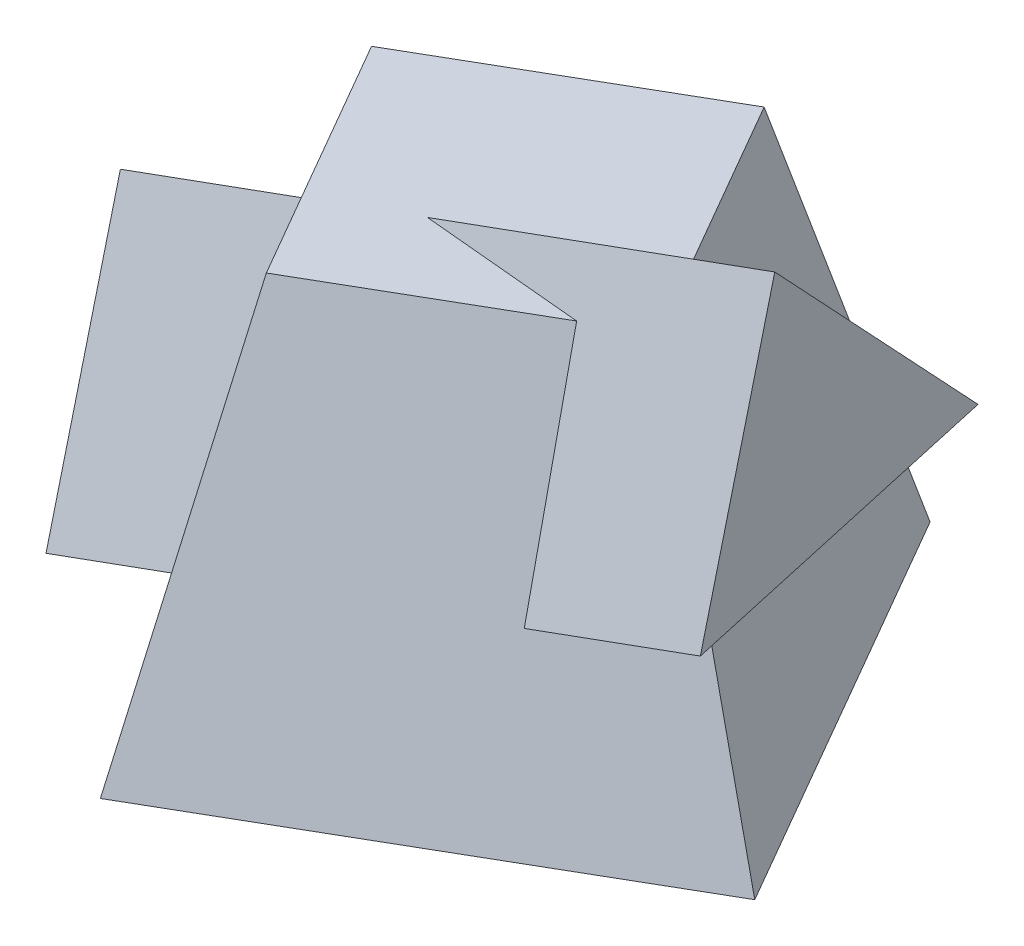
ISO-10303-21;
HEADER;
FILE_DESCRIPTION(('STEP AP214'),'2;1');
FILE_NAME('part.step','',(''),(''),'','','');
FILE_SCHEMA(('AUTOMOTIVE_DESIGN { 1 0 10303 214 1 1 1 1 }'));
ENDSEC;
DATA;
#1=APPLICATION_CONTEXT('core data for automotive mechanical design processes');
#2=APPLICATION_PROTOCOL_DEFINITION('international standard','automotive_design',2000,#1);
#3=PRODUCT_CONTEXT('',#1,'mechanical');
#4=PRODUCT('Part','Part','',(#3));
#5=PRODUCT_RELATED_PRODUCT_CATEGORY('part','',(#4));
#6=PRODUCT_DEFINITION_FORMATION('','',#4);
#7=PRODUCT_DEFINITION_CONTEXT('part definition',#1,'design');
#8=PRODUCT_DEFINITION('design','',#6,#7);
#9=PRODUCT_DEFINITION_SHAPE('','',#8);
#10=(LENGTH_UNIT() NAMED_UNIT(*) SI_UNIT(.MILLI.,.METRE.));
#11=(NAMED_UNIT(*) PLANE_ANGLE_UNIT() SI_UNIT($,.RADIAN.));
#12=(NAMED_UNIT(*) SI_UNIT($,.STERADIAN.) SOLID_ANGLE_UNIT());
#13=UNCERTAINTY_MEASURE_WITH_UNIT(LENGTH_MEASURE(1.E-05),#10,'distance_accuracy_value','');
#14=(GEOMETRIC_REPRESENTATION_CONTEXT(3) GLOBAL_UNCERTAINTY_ASSIGNED_CONTEXT((#13)) GLOBAL_UNIT_ASSIGNED_CONTEXT((#10,
#11,#12)) REPRESENTATION_CONTEXT('',''));
#15=CARTESIAN_POINT('',(0.,0.,0.));
#16=DIRECTION('',(0.,0.,1.));
#17=DIRECTION('',(1.,0.,0.));
#18=AXIS2_PLACEMENT_3D('',#15,#16,#17);
#19=CARTESIAN_POINT('',(67.8339255410781,72.736045173465,40.));
#20=DIRECTION('',(0.241844762647974,-0.66446302438867,0.707106781186552));
#21=DIRECTION('',(0.,-0.728739444818688,-0.684791078771731));
#22=AXIS2_PLACEMENT_3D('',#19,#20,#21);
#23=PLANE('',#22);
#24=DIRECTION('',(0.,0.728739444818687,0.684791078771731));
#25=VECTOR('',#24,1.);
#26=CARTESIAN_POINT('',(50.0000000000001,69.6921548150222,43.2392404613087));
#27=LINE('',#26,#25);
#28=CARTESIAN_POINT('',(50.0000000000001,66.2450271163929,40.));
#29=VERTEX_POINT('',#28);
#30=CARTESIAN_POINT('',(50.0000000000001,111.394266274736,82.4264068711926));
#31=VERTEX_POINT('',#30);
#32=EDGE_CURVE('E53',#29,#31,#27,.T.);
#33=ORIENTED_EDGE('',*,*,#32,.F.);
#34=DIRECTION('',(-0.939692620785908,-0.342020143325669,0.));
#35=VECTOR('',#34,1.);
#36=CARTESIAN_POINT('',(67.8339255410781,72.736045173465,40.));
#37=LINE('',#36,#35);
#38=CARTESIAN_POINT('',(9.13654842765041,51.3719470746791,40.));
#39=VERTEX_POINT('',#38);
#40=EDGE_CURVE('E136',#29,#39,#37,.T.);
#41=ORIENTED_EDGE('',*,*,#40,.T.);
#42=DIRECTION('',(-0.168826423532356,-0.746439367487045,-0.643681527917971));
#43=VECTOR('',#42,1.);
#44=CARTESIAN_POINT('',(18.0291135696183,90.6890193731141,73.9045263053562));
#45=LINE('',#44,#43);
#46=CARTESIAN_POINT('',(16.7423958052504,85.,68.9986801751217));
#47=VERTEX_POINT('',#46);
#48=EDGE_CURVE('E283',#47,#39,#45,.T.);
#49=ORIENTED_EDGE('',*,*,#48,.F.);
#50=DIRECTION('',(0.946188648339466,0.,-0.323615577118181));
#51=VECTOR('',#50,1.);
#52=CARTESIAN_POINT('',(-36.7968483324716,85.,87.3101801286532));
#53=LINE('',#52,#51);
#54=CARTESIAN_POINT('',(-22.5176505929094,85.,82.4264068711926));
#55=VERTEX_POINT('',#54);
#56=EDGE_CURVE('E141',#55,#47,#53,.T.);
#57=ORIENTED_EDGE('',*,*,#56,.F.);
#58=DIRECTION('',(-0.939692620785908,-0.342020143325669,0.));
#59=VECTOR('',#58,1.);
#60=CARTESIAN_POINT('',(53.3232397821995,112.603826636786,82.4264068711926));
#61=LINE('',#60,#59);
#62=EDGE_CURVE('E393',#31,#55,#61,.T.);
#63=ORIENTED_EDGE('',*,*,#62,.F.);
#64=EDGE_LOOP('',(#33,#41,#49,#57,#63));
#65=FACE_BOUND('',#64,.T.);
#66=ADVANCED_FACE('F38',(#65),#23,.F.);
#67=CARTESIAN_POINT('',(73.1452051551606,58.1434243653638,97.9555495773442));
#68=DIRECTION('',(-0.330366089549353,0.90767337119037,0.258819045102514));
#69=DIRECTION('',(-0.939692620785908,-0.342020143325669,0.));
#70=AXIS2_PLACEMENT_3D('',#67,#68,#69);
#71=PLANE('',#70);
#72=DIRECTION('',(0.,0.274215454929753,-0.961668281829898));
#73=VECTOR('',#72,1.);
#74=CARTESIAN_POINT('',(50.0000000000001,50.3527063166036,95.7340608017083));
#75=LINE('',#74,#73);
#76=CARTESIAN_POINT('',(50.0000000000001,49.7192586229007,97.9555495773442));
#77=VERTEX_POINT('',#76);
#78=EDGE_CURVE('E126',#77,#29,#75,.T.);
#79=ORIENTED_EDGE('',*,*,#78,.F.);
#80=DIRECTION('',(-0.939692620785908,-0.342020143325669,0.));
#81=VECTOR('',#80,1.);
#82=CARTESIAN_POINT('',(73.1452051551606,58.1434243653638,97.9555495773442));
#83=LINE('',#82,#81);
#84=CARTESIAN_POINT('',(13.2357054899157,36.3381497374336,97.9555495773442));
#85=VERTEX_POINT('',#84);
#86=EDGE_CURVE('E133',#77,#85,#83,.T.);
#87=ORIENTED_EDGE('',*,*,#86,.T.);
#88=DIRECTION('',(-0.732124817810615,-0.419500219702806,0.536668255829494));
#89=VECTOR('',#88,1.);
#90=CARTESIAN_POINT('',(0.940988545840807,29.2933995339821,106.967925797598));
#91=LINE('',#90,#89);
#92=CARTESIAN_POINT('',(34.4189699234139,48.4759490138595,82.4276159521775));
#93=VERTEX_POINT('',#92);
#94=EDGE_CURVE('E158',#93,#85,#91,.T.);
#95=ORIENTED_EDGE('',*,*,#94,.F.);
#96=DIRECTION('',(0.511022991067174,-0.058535595232156,0.85757162190197));
#97=VECTOR('',#96,1.);
#98=CARTESIAN_POINT('',(28.8822077757174,49.1101624908255,73.1361160038682));
#99=LINE('',#98,#97);
#100=EDGE_CURVE('E285',#39,#93,#99,.T.);
#101=ORIENTED_EDGE('',*,*,#100,.F.);
#102=ORIENTED_EDGE('',*,*,#40,.F.);
#103=EDGE_LOOP('',(#79,#87,#95,#101,#102));
#104=FACE_BOUND('',#103,.T.);
#105=ADVANCED_FACE('F132',(#104),#71,.F.);
#106=CARTESIAN_POINT('',(53.3232397821995,112.603826636786,82.4264068711926));
#107=DIRECTION('',(0.0885213269013792,-0.2432103468017,-0.965925826289067));
#108=DIRECTION('',(0.,0.96973272377945,-0.244168885059686));
#109=AXIS2_PLACEMENT_3D('',#106,#107,#108);
#110=PLANE('',#109);
#111=DIRECTION('',(0.,-0.969732723779449,0.244168885059686));
#112=VECTOR('',#111,1.);
#113=CARTESIAN_POINT('',(50.0000000000001,112.531714529555,82.1400089128874));
#114=LINE('',#113,#112);
#115=EDGE_CURVE('E12',#31,#77,#114,.T.);
#116=ORIENTED_EDGE('',*,*,#115,.F.);
#117=ORIENTED_EDGE('',*,*,#62,.T.);
#118=DIRECTION('',(-0.995826954258741,0.,-0.0912615865069148));
#119=VECTOR('',#118,1.);
#120=CARTESIAN_POINT('',(-26.7850346311962,85.,82.0353266379223));
#121=LINE('',#120,#119);
#122=CARTESIAN_POINT('',(11.7878855831014,85.,85.57030415576));
#123=VERTEX_POINT('',#122);
#124=EDGE_CURVE('E166',#123,#55,#121,.T.);
#125=ORIENTED_EDGE('',*,*,#124,.F.);
#126=DIRECTION('',(-0.0288214483420717,0.968701284580497,-0.246550492531572));
#127=VECTOR('',#126,1.);
#128=CARTESIAN_POINT('',(11.9222639644053,80.483484763017,86.7198319554333));
#129=LINE('',#128,#127);
#130=EDGE_CURVE('E47',#85,#123,#129,.T.);
#131=ORIENTED_EDGE('',*,*,#130,.F.);
#132=ORIENTED_EDGE('',*,*,#86,.F.);
#133=EDGE_LOOP('',(#116,#117,#125,#131,#132));
#134=FACE_BOUND('',#133,.T.);
#135=ADVANCED_FACE('F138',(#134),#110,.F.);
#136=DIRECTION('',(0.,0.969732723779449,-0.244168885059686));
#137=VECTOR('',#136,1.);
#138=CARTESIAN_POINT('',(-86.6025403784438,109.56752967218,70.3675545527638));
#139=LINE('',#138,#137);
#140=CARTESIAN_POINT('',(-86.6025403784438,0.,97.9555495773442));
#141=VERTEX_POINT('',#140);
#142=CARTESIAN_POINT('',(-86.6025403784438,61.6750076518352,82.4264068711926));
#143=VERTEX_POINT('',#142);
#144=EDGE_CURVE('E61',#141,#143,#139,.T.);
#145=ORIENTED_EDGE('',*,*,#144,.F.);
#146=CARTESIAN_POINT('',(-55.8769830243074,11.1831883081447,97.9555495773442));
#147=VERTEX_POINT('',#146);
#148=EDGE_CURVE('E142',#147,#141,#83,.T.);
#149=ORIENTED_EDGE('',*,*,#148,.F.);
#150=DIRECTION('',(-0.128632711212537,-0.964403827678245,0.231038704042552));
#151=VECTOR('',#150,1.);
#152=CARTESIAN_POINT('',(-45.5684241345364,88.4700118340479,79.4402274327006));
#153=LINE('',#152,#151);
#154=CARTESIAN_POINT('',(-47.2310042590752,76.0050748766221,82.4264068711926));
#155=VERTEX_POINT('',#154);
#156=EDGE_CURVE('E169',#155,#147,#153,.T.);
#157=ORIENTED_EDGE('',*,*,#156,.F.);
#158=EDGE_CURVE('E399',#155,#143,#61,.T.);
#159=ORIENTED_EDGE('',*,*,#158,.T.);
#160=EDGE_LOOP('',(#145,#149,#157,#159));
#161=FACE_BOUND('',#160,.T.);
#162=ADVANCED_FACE('F414',(#161),#110,.F.);
#163=DIRECTION('',(0.,-0.274215454929753,0.961668281829898));
#164=VECTOR('',#163,1.);
#165=CARTESIAN_POINT('',(-86.6025403784438,4.37204338022178,82.6228782418765));
#166=LINE('',#165,#164);
#167=CARTESIAN_POINT('',(-86.6025403784438,16.5257684934922,40.));
#168=VERTEX_POINT('',#167);
#169=EDGE_CURVE('E403',#168,#141,#166,.T.);
#170=ORIENTED_EDGE('',*,*,#169,.F.);
#171=CARTESIAN_POINT('',(-56.3180731922187,27.5484131098897,40.));
#172=VERTEX_POINT('',#171);
#173=EDGE_CURVE('E395',#172,#168,#37,.T.);
#174=ORIENTED_EDGE('',*,*,#173,.F.);
#175=DIRECTION('',(0.833950638272695,0.409129328344723,-0.370323541801978));
#176=VECTOR('',#175,1.);
#177=CARTESIAN_POINT('',(1.27638775563456,55.8037822439396,14.424643632912));
#178=LINE('',#177,#176);
#179=CARTESIAN_POINT('',(-81.7597618260386,15.0669297882033,51.2976186022398));
#180=VERTEX_POINT('',#179);
#181=EDGE_CURVE('E160',#180,#172,#178,.T.);
#182=ORIENTED_EDGE('',*,*,#181,.F.);
#183=DIRECTION('',(-0.48381441259769,0.0725969231221106,-0.872154401993107));
#184=VECTOR('',#183,1.);
#185=CARTESIAN_POINT('',(-76.4131222930323,14.2646602215419,60.9358085427683));
#186=LINE('',#185,#184);
#187=EDGE_CURVE('E163',#147,#180,#186,.T.);
#188=ORIENTED_EDGE('',*,*,#187,.F.);
#189=ORIENTED_EDGE('',*,*,#148,.T.);
#190=EDGE_LOOP('',(#170,#174,#182,#188,#189));
#191=FACE_BOUND('',#190,.T.);
#192=ADVANCED_FACE('F411',(#191),#71,.F.);
#193=DIRECTION('',(0.,-0.728739444818687,-0.684791078771731));
#194=VECTOR('',#193,1.);
#195=CARTESIAN_POINT('',(-86.6025403784438,46.3768642672962,68.0508544210167));
#196=LINE('',#195,#194);
#197=EDGE_CURVE('E405',#143,#168,#196,.T.);
#198=ORIENTED_EDGE('',*,*,#197,.F.);
#199=ORIENTED_EDGE('',*,*,#158,.F.);
#200=DIRECTION('',(0.485389547003972,0.713852389733977,0.504788820528317));
#201=VECTOR('',#200,1.);
#202=CARTESIAN_POINT('',(-53.1049804653403,67.3663392920493,76.3176689734074));
#203=LINE('',#202,#201);
#204=CARTESIAN_POINT('',(-75.5682424785903,34.3300834263091,52.9566312113103));
#205=VERTEX_POINT('',#204);
#206=EDGE_CURVE('E155',#205,#155,#203,.T.);
#207=ORIENTED_EDGE('',*,*,#206,.F.);
#208=DIRECTION('',(-0.796281602416689,0.280523211317587,0.535949939420445));
#209=VECTOR('',#208,1.);
#210=CARTESIAN_POINT('',(-32.6725475886282,19.2182962825259,24.0850046310912));
#211=LINE('',#210,#209);
#212=EDGE_CURVE('E145',#172,#205,#211,.T.);
#213=ORIENTED_EDGE('',*,*,#212,.F.);
#214=ORIENTED_EDGE('',*,*,#173,.T.);
#215=EDGE_LOOP('',(#198,#199,#207,#213,#214));
#216=FACE_BOUND('',#215,.T.);
#217=ADVANCED_FACE('F415',(#216),#23,.F.);
#218=CARTESIAN_POINT('',(-29.282032302755,85.,109.282032302755));
#219=DIRECTION('',(0.,1.,0.));
#220=DIRECTION('',(0.,0.,1.));
#221=AXIS2_PLACEMENT_3D('',#218,#219,#220);
#222=PLANE('',#221);
#223=DIRECTION('',(0.866025403784439,0.,-0.5));
#224=VECTOR('',#223,1.);
#225=CARTESIAN_POINT('',(22.6794919243112,85.,79.2820323027551));
#226=LINE('',#225,#224);
#227=CARTESIAN_POINT('',(-29.282032302755,85.,109.282032302755));
#228=VERTEX_POINT('',#227);
#229=EDGE_CURVE('E180',#228,#123,#226,.T.);
#230=ORIENTED_EDGE('',*,*,#229,.T.);
#231=ORIENTED_EDGE('',*,*,#124,.T.);
#232=ORIENTED_EDGE('',*,*,#56,.T.);
#233=DIRECTION('',(-0.5,0.,-0.866025403784439));
#234=VECTOR('',#233,1.);
#235=CARTESIAN_POINT('',(-7.32050807568869,85.,27.3205080756889));
#236=LINE('',#235,#234);
#237=CARTESIAN_POINT('',(-7.32050807568869,85.,27.3205080756889));
#238=VERTEX_POINT('',#237);
#239=EDGE_CURVE('E280',#47,#238,#236,.T.);
#240=ORIENTED_EDGE('',*,*,#239,.T.);
#241=DIRECTION('',(-0.866025403784439,0.,0.5));
#242=VECTOR('',#241,1.);
#243=CARTESIAN_POINT('',(-59.2820323027549,85.,57.3205080756888));
#244=LINE('',#243,#242);
#245=CARTESIAN_POINT('',(-59.2820323027549,85.,57.3205080756888));
#246=VERTEX_POINT('',#245);
#247=EDGE_CURVE('E304',#238,#246,#244,.T.);
#248=ORIENTED_EDGE('',*,*,#247,.T.);
#249=DIRECTION('',(0.5,0.,0.866025403784439));
#250=VECTOR('',#249,1.);
#251=CARTESIAN_POINT('',(-29.282032302755,85.,109.282032302755));
#252=LINE('',#251,#250);
#253=EDGE_CURVE('E326',#246,#228,#252,.T.);
#254=ORIENTED_EDGE('',*,*,#253,.T.);
#255=EDGE_LOOP('',(#230,#231,#232,#240,#248,#254));
#256=FACE_BOUND('',#255,.T.);
#257=ADVANCED_FACE('F40',(#256),#222,.T.);
#258=CARTESIAN_POINT('',(-59.2820323027549,85.,57.3205080756888));
#259=DIRECTION('',(-0.84300399625679,0.229039333725549,0.486708584166788));
#260=DIRECTION('',(0.5,0.,0.866025403784439));
#261=AXIS2_PLACEMENT_3D('',#258,#259,#260);
#262=PLANE('',#261);
#263=ORIENTED_EDGE('',*,*,#156,.T.);
#264=ORIENTED_EDGE('',*,*,#187,.T.);
#265=DIRECTION('',(-0.304976412246324,-0.948847472716111,-0.0817181833719424));
#266=VECTOR('',#265,1.);
#267=CARTESIAN_POINT('',(-59.2820323027549,85.,57.3205080756888));
#268=LINE('',#267,#266);
#269=CARTESIAN_POINT('',(-86.6025403784438,0.,50.0000000000001));
#270=VERTEX_POINT('',#269);
#271=EDGE_CURVE('E290',#180,#270,#268,.T.);
#272=ORIENTED_EDGE('',*,*,#271,.T.);
#273=DIRECTION('',(0.500000000000001,0.,0.866025403784438));
#274=VECTOR('',#273,1.);
#275=CARTESIAN_POINT('',(-86.6025403784438,0.,50.0000000000001));
#276=LINE('',#275,#274);
#277=CARTESIAN_POINT('',(-36.6025403784437,0.,136.602540378444));
#278=VERTEX_POINT('',#277);
#279=EDGE_CURVE('E219',#270,#278,#276,.T.);
#280=ORIENTED_EDGE('',*,*,#279,.T.);
#281=DIRECTION('',(-0.0817181833719423,-0.948847472716111,0.304976412246324));
#282=VECTOR('',#281,1.);
#283=CARTESIAN_POINT('',(-29.282032302755,85.,109.282032302755));
#284=LINE('',#283,#282);
#285=EDGE_CURVE('E186',#228,#278,#284,.T.);
#286=ORIENTED_EDGE('',*,*,#285,.F.);
#287=ORIENTED_EDGE('',*,*,#253,.F.);
#288=EDGE_CURVE('E293',#246,#205,#268,.T.);
#289=ORIENTED_EDGE('',*,*,#288,.T.);
#290=ORIENTED_EDGE('',*,*,#206,.T.);
#291=EDGE_LOOP('',(#263,#264,#272,#280,#286,#287,#289,#290));
#292=FACE_BOUND('',#291,.T.);
#293=ADVANCED_FACE('F198',(#292),#262,.T.);
#294=CARTESIAN_POINT('',(-29.282032302755,85.,109.282032302755));
#295=DIRECTION('',(0.486708584166788,0.229039333725549,0.84300399625679));
#296=DIRECTION('',(0.866025403784439,0.,-0.5));
#297=AXIS2_PLACEMENT_3D('',#294,#295,#296);
#298=PLANE('',#297);
#299=ORIENTED_EDGE('',*,*,#94,.T.);
#300=ORIENTED_EDGE('',*,*,#130,.T.);
#301=ORIENTED_EDGE('',*,*,#229,.F.);
#302=ORIENTED_EDGE('',*,*,#285,.T.);
#303=DIRECTION('',(0.866025403784438,0.,-0.500000000000001));
#304=VECTOR('',#303,1.);
#305=CARTESIAN_POINT('',(-36.6025403784437,0.,136.602540378444));
#306=LINE('',#305,#304);
#307=CARTESIAN_POINT('',(50.0000000000001,0.,86.6025403784438));
#308=VERTEX_POINT('',#307);
#309=EDGE_CURVE('E313',#278,#308,#306,.T.);
#310=ORIENTED_EDGE('',*,*,#309,.T.);
#311=DIRECTION('',(0.304976412246323,-0.948847472716111,0.0817181833719425));
#312=VECTOR('',#311,1.);
#313=CARTESIAN_POINT('',(22.6794919243112,85.,79.2820323027551));
#314=LINE('',#313,#312);
#315=EDGE_CURVE('E312',#93,#308,#314,.T.);
#316=ORIENTED_EDGE('',*,*,#315,.F.);
#317=EDGE_LOOP('',(#299,#300,#301,#302,#310,#316));
#318=FACE_BOUND('',#317,.T.);
#319=ADVANCED_FACE('F188',(#318),#298,.T.);
#320=CARTESIAN_POINT('',(-7.32050807568869,85.,27.3205080756889));
#321=DIRECTION('',(-0.486708584166788,0.229039333725549,-0.84300399625679));
#322=DIRECTION('',(-0.866025403784439,0.,0.5));
#323=AXIS2_PLACEMENT_3D('',#320,#321,#322);
#324=PLANE('',#323);
#325=ORIENTED_EDGE('',*,*,#271,.F.);
#326=ORIENTED_EDGE('',*,*,#181,.T.);
#327=ORIENTED_EDGE('',*,*,#212,.T.);
#328=ORIENTED_EDGE('',*,*,#288,.F.);
#329=ORIENTED_EDGE('',*,*,#247,.F.);
#330=DIRECTION('',(0.0817181833719423,-0.948847472716111,-0.304976412246324));
#331=VECTOR('',#330,1.);
#332=CARTESIAN_POINT('',(-7.32050807568869,85.,27.3205080756889));
#333=LINE('',#332,#331);
#334=CARTESIAN_POINT('',(0.,0.,0.));
#335=VERTEX_POINT('',#334);
#336=EDGE_CURVE('E294',#238,#335,#333,.T.);
#337=ORIENTED_EDGE('',*,*,#336,.T.);
#338=DIRECTION('',(-0.866025403784438,0.,0.500000000000001));
#339=VECTOR('',#338,1.);
#340=CARTESIAN_POINT('',(0.,0.,0.));
#341=LINE('',#340,#339);
#342=EDGE_CURVE('E233',#335,#270,#341,.T.);
#343=ORIENTED_EDGE('',*,*,#342,.T.);
#344=EDGE_LOOP('',(#325,#326,#327,#328,#329,#337,#343));
#345=FACE_BOUND('',#344,.T.);
#346=ADVANCED_FACE('F197',(#345),#324,.T.);
#347=CARTESIAN_POINT('',(22.6794919243112,85.,79.2820323027551));
#348=DIRECTION('',(0.84300399625679,0.229039333725549,-0.486708584166788));
#349=DIRECTION('',(-0.5,0.,-0.866025403784439));
#350=AXIS2_PLACEMENT_3D('',#347,#348,#349);
#351=PLANE('',#350);
#352=ORIENTED_EDGE('',*,*,#48,.T.);
#353=ORIENTED_EDGE('',*,*,#100,.T.);
#354=ORIENTED_EDGE('',*,*,#315,.T.);
#355=DIRECTION('',(-0.500000000000001,0.,-0.866025403784438));
#356=VECTOR('',#355,1.);
#357=CARTESIAN_POINT('',(50.0000000000001,0.,86.6025403784438));
#358=LINE('',#357,#356);
#359=EDGE_CURVE('E174',#308,#335,#358,.T.);
#360=ORIENTED_EDGE('',*,*,#359,.T.);
#361=ORIENTED_EDGE('',*,*,#336,.F.);
#362=ORIENTED_EDGE('',*,*,#239,.F.);
#363=EDGE_LOOP('',(#352,#353,#354,#360,#361,#362));
#364=FACE_BOUND('',#363,.T.);
#365=ADVANCED_FACE('F252',(#364),#351,.T.);
#366=CARTESIAN_POINT('',(0.,0.,0.));
#367=DIRECTION('',(0.,1.,0.));
#368=DIRECTION('',(0.,0.,1.));
#369=AXIS2_PLACEMENT_3D('',#366,#367,#368);
#370=PLANE('',#369);
#371=ORIENTED_EDGE('',*,*,#359,.F.);
#372=ORIENTED_EDGE('',*,*,#309,.F.);
#373=ORIENTED_EDGE('',*,*,#279,.F.);
#374=ORIENTED_EDGE('',*,*,#342,.F.);
#375=EDGE_LOOP('',(#371,#372,#373,#374));
#376=FACE_BOUND('',#375,.T.);
#377=ADVANCED_FACE('F261',(#376),#370,.F.);
#378=CARTESIAN_POINT('',(-86.6025403784438,0.,100.));
#379=DIRECTION('',(-1.,0.,0.));
#380=DIRECTION('',(0.,0.,1.));
#381=AXIS2_PLACEMENT_3D('',#378,#379,#380);
#382=PLANE('',#381);
#383=ORIENTED_EDGE('',*,*,#144,.T.);
#384=ORIENTED_EDGE('',*,*,#197,.T.);
#385=ORIENTED_EDGE('',*,*,#169,.T.);
#386=EDGE_LOOP('',(#383,#384,#385));
#387=FACE_BOUND('',#386,.T.);
#388=ADVANCED_FACE('F408',(#387),#382,.T.);
#389=CARTESIAN_POINT('',(50.0000000000001,0.,100.));
#390=DIRECTION('',(1.,0.,0.));
#391=DIRECTION('',(0.,0.,-1.));
#392=AXIS2_PLACEMENT_3D('',#389,#390,#391);
#393=PLANE('',#392);
#394=ORIENTED_EDGE('',*,*,#32,.T.);
#395=ORIENTED_EDGE('',*,*,#115,.T.);
#396=ORIENTED_EDGE('',*,*,#78,.T.);
#397=EDGE_LOOP('',(#394,#395,#396));
#398=FACE_BOUND('',#397,.T.);
#399=ADVANCED_FACE('F125',(#398),#393,.T.);
#400=CLOSED_SHELL('',(#66,#105,#135,#162,#192,#217,#257,#293,#319,#346,#365,#377,#388,#399));
#401=MANIFOLD_SOLID_BREP('B2',#400);
#402=ADVANCED_BREP_SHAPE_REPRESENTATION('',(#18,#401),#14);
#403=SHAPE_DEFINITION_REPRESENTATION(#9,#402);
ENDSEC;
END-ISO-10303-21;
